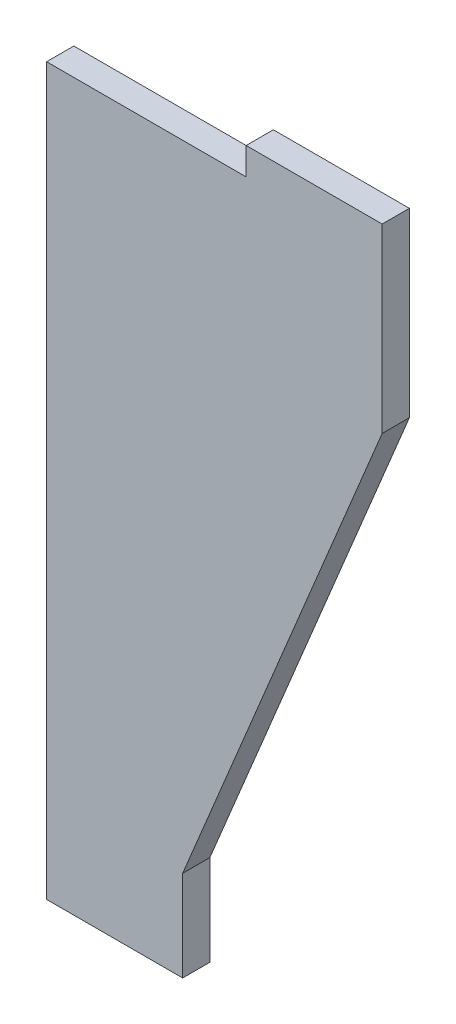
ISO-10303-21;
HEADER;
FILE_DESCRIPTION(('STEP AP214'),'2;1');
FILE_NAME('part.step','',(''),(''),'','','');
FILE_SCHEMA(('AUTOMOTIVE_DESIGN { 1 0 10303 214 1 1 1 1 }'));
ENDSEC;
DATA;
#1=APPLICATION_CONTEXT('core data for automotive mechanical design processes');
#2=APPLICATION_PROTOCOL_DEFINITION('international standard','automotive_design',2000,#1);
#3=PRODUCT_CONTEXT('',#1,'mechanical');
#4=PRODUCT('Part','Part','',(#3));
#5=PRODUCT_RELATED_PRODUCT_CATEGORY('part','',(#4));
#6=PRODUCT_DEFINITION_FORMATION('','',#4);
#7=PRODUCT_DEFINITION_CONTEXT('part definition',#1,'design');
#8=PRODUCT_DEFINITION('design','',#6,#7);
#9=PRODUCT_DEFINITION_SHAPE('','',#8);
#10=(LENGTH_UNIT() NAMED_UNIT(*) SI_UNIT(.MILLI.,.METRE.));
#11=(NAMED_UNIT(*) PLANE_ANGLE_UNIT() SI_UNIT($,.RADIAN.));
#12=(NAMED_UNIT(*) SI_UNIT($,.STERADIAN.) SOLID_ANGLE_UNIT());
#13=UNCERTAINTY_MEASURE_WITH_UNIT(LENGTH_MEASURE(1.E-05),#10,'distance_accuracy_value','');
#14=(GEOMETRIC_REPRESENTATION_CONTEXT(3) GLOBAL_UNCERTAINTY_ASSIGNED_CONTEXT((#13)) GLOBAL_UNIT_ASSIGNED_CONTEXT((#10,
#11,#12)) REPRESENTATION_CONTEXT('',''));
#15=CARTESIAN_POINT('',(0.,0.,0.));
#16=DIRECTION('',(0.,0.,1.));
#17=DIRECTION('',(1.,0.,0.));
#18=AXIS2_PLACEMENT_3D('',#15,#16,#17);
#19=CARTESIAN_POINT('',(0.,0.,-3.));
#20=DIRECTION('',(-1.,0.,0.));
#21=DIRECTION('',(0.,0.,1.));
#22=AXIS2_PLACEMENT_3D('',#19,#20,#21);
#23=PLANE('',#22);
#24=DIRECTION('',(0.,-1.,0.));
#25=VECTOR('',#24,1.);
#26=CARTESIAN_POINT('',(0.,0.,0.));
#27=LINE('',#26,#25);
#28=CARTESIAN_POINT('',(0.,0.,0.));
#29=VERTEX_POINT('',#28);
#30=CARTESIAN_POINT('',(0.,-80.,0.));
#31=VERTEX_POINT('',#30);
#32=EDGE_CURVE('E132',#29,#31,#27,.T.);
#33=ORIENTED_EDGE('',*,*,#32,.F.);
#34=DIRECTION('',(0.,0.,1.));
#35=VECTOR('',#34,1.);
#36=CARTESIAN_POINT('',(0.,0.,-3.));
#37=LINE('',#36,#35);
#38=CARTESIAN_POINT('',(0.,0.,-3.));
#39=VERTEX_POINT('',#38);
#40=EDGE_CURVE('E11',#39,#29,#37,.T.);
#41=ORIENTED_EDGE('',*,*,#40,.F.);
#42=DIRECTION('',(0.,-1.,0.));
#43=VECTOR('',#42,1.);
#44=CARTESIAN_POINT('',(0.,0.,-3.));
#45=LINE('',#44,#43);
#46=CARTESIAN_POINT('',(0.,-80.,-3.));
#47=VERTEX_POINT('',#46);
#48=EDGE_CURVE('E152',#39,#47,#45,.T.);
#49=ORIENTED_EDGE('',*,*,#48,.T.);
#50=DIRECTION('',(0.,0.,1.));
#51=VECTOR('',#50,1.);
#52=CARTESIAN_POINT('',(0.,-80.,-3.));
#53=LINE('',#52,#51);
#54=EDGE_CURVE('E38',#47,#31,#53,.T.);
#55=ORIENTED_EDGE('',*,*,#54,.T.);
#56=EDGE_LOOP('',(#33,#41,#49,#55));
#57=FACE_BOUND('',#56,.T.);
#58=ADVANCED_FACE('F35',(#57),#23,.T.);
#59=CARTESIAN_POINT('',(22.,0.,-3.));
#60=DIRECTION('',(0.,1.,0.));
#61=DIRECTION('',(-1.,0.,0.));
#62=AXIS2_PLACEMENT_3D('',#59,#60,#61);
#63=PLANE('',#62);
#64=DIRECTION('',(-1.,0.,0.));
#65=VECTOR('',#64,1.);
#66=CARTESIAN_POINT('',(22.,0.,0.));
#67=LINE('',#66,#65);
#68=CARTESIAN_POINT('',(22.,0.,0.));
#69=VERTEX_POINT('',#68);
#70=EDGE_CURVE('E150',#69,#29,#67,.T.);
#71=ORIENTED_EDGE('',*,*,#70,.F.);
#72=DIRECTION('',(0.,0.,1.));
#73=VECTOR('',#72,1.);
#74=CARTESIAN_POINT('',(22.,0.,-3.));
#75=LINE('',#74,#73);
#76=CARTESIAN_POINT('',(22.,0.,-3.));
#77=VERTEX_POINT('',#76);
#78=EDGE_CURVE('E44',#77,#69,#75,.T.);
#79=ORIENTED_EDGE('',*,*,#78,.F.);
#80=DIRECTION('',(-1.,0.,0.));
#81=VECTOR('',#80,1.);
#82=CARTESIAN_POINT('',(22.,0.,-3.));
#83=LINE('',#82,#81);
#84=EDGE_CURVE('E122',#77,#39,#83,.T.);
#85=ORIENTED_EDGE('',*,*,#84,.T.);
#86=ORIENTED_EDGE('',*,*,#40,.T.);
#87=EDGE_LOOP('',(#71,#79,#85,#86));
#88=FACE_BOUND('',#87,.T.);
#89=ADVANCED_FACE('F164',(#88),#63,.T.);
#90=CARTESIAN_POINT('',(22.,3.,-3.));
#91=DIRECTION('',(-1.,0.,0.));
#92=DIRECTION('',(0.,0.,1.));
#93=AXIS2_PLACEMENT_3D('',#90,#91,#92);
#94=PLANE('',#93);
#95=DIRECTION('',(0.,-1.,0.));
#96=VECTOR('',#95,1.);
#97=CARTESIAN_POINT('',(22.,3.,0.));
#98=LINE('',#97,#96);
#99=CARTESIAN_POINT('',(22.,3.,0.));
#100=VERTEX_POINT('',#99);
#101=EDGE_CURVE('E109',#100,#69,#98,.T.);
#102=ORIENTED_EDGE('',*,*,#101,.F.);
#103=DIRECTION('',(0.,0.,1.));
#104=VECTOR('',#103,1.);
#105=CARTESIAN_POINT('',(22.,3.,-3.));
#106=LINE('',#105,#104);
#107=CARTESIAN_POINT('',(22.,3.,-3.));
#108=VERTEX_POINT('',#107);
#109=EDGE_CURVE('E104',#108,#100,#106,.T.);
#110=ORIENTED_EDGE('',*,*,#109,.F.);
#111=DIRECTION('',(0.,-1.,0.));
#112=VECTOR('',#111,1.);
#113=CARTESIAN_POINT('',(22.,3.,-3.));
#114=LINE('',#113,#112);
#115=EDGE_CURVE('E107',#108,#77,#114,.T.);
#116=ORIENTED_EDGE('',*,*,#115,.T.);
#117=ORIENTED_EDGE('',*,*,#78,.T.);
#118=EDGE_LOOP('',(#102,#110,#116,#117));
#119=FACE_BOUND('',#118,.T.);
#120=ADVANCED_FACE('F106',(#119),#94,.T.);
#121=CARTESIAN_POINT('',(37.,3.00000000000001,-3.));
#122=DIRECTION('',(0.,1.,0.));
#123=DIRECTION('',(-1.,0.,0.));
#124=AXIS2_PLACEMENT_3D('',#121,#122,#123);
#125=PLANE('',#124);
#126=DIRECTION('',(-1.,0.,0.));
#127=VECTOR('',#126,1.);
#128=CARTESIAN_POINT('',(37.,3.00000000000001,0.));
#129=LINE('',#128,#127);
#130=CARTESIAN_POINT('',(37.,3.00000000000001,0.));
#131=VERTEX_POINT('',#130);
#132=EDGE_CURVE('E147',#131,#100,#129,.T.);
#133=ORIENTED_EDGE('',*,*,#132,.F.);
#134=DIRECTION('',(0.,0.,1.));
#135=VECTOR('',#134,1.);
#136=CARTESIAN_POINT('',(37.,3.00000000000001,-3.));
#137=LINE('',#136,#135);
#138=CARTESIAN_POINT('',(37.,3.00000000000001,-3.));
#139=VERTEX_POINT('',#138);
#140=EDGE_CURVE('E114',#139,#131,#137,.T.);
#141=ORIENTED_EDGE('',*,*,#140,.F.);
#142=DIRECTION('',(-1.,0.,0.));
#143=VECTOR('',#142,1.);
#144=CARTESIAN_POINT('',(37.,3.00000000000001,-3.));
#145=LINE('',#144,#143);
#146=EDGE_CURVE('E120',#139,#108,#145,.T.);
#147=ORIENTED_EDGE('',*,*,#146,.T.);
#148=ORIENTED_EDGE('',*,*,#109,.T.);
#149=EDGE_LOOP('',(#133,#141,#147,#148));
#150=FACE_BOUND('',#149,.T.);
#151=ADVANCED_FACE('F124',(#150),#125,.T.);
#152=CARTESIAN_POINT('',(37.,-17.,-3.));
#153=DIRECTION('',(1.,0.,0.));
#154=DIRECTION('',(0.,0.,-1.));
#155=AXIS2_PLACEMENT_3D('',#152,#153,#154);
#156=PLANE('',#155);
#157=DIRECTION('',(0.,1.,0.));
#158=VECTOR('',#157,1.);
#159=CARTESIAN_POINT('',(37.,-17.,0.));
#160=LINE('',#159,#158);
#161=CARTESIAN_POINT('',(37.,-17.,0.));
#162=VERTEX_POINT('',#161);
#163=EDGE_CURVE('E144',#162,#131,#160,.T.);
#164=ORIENTED_EDGE('',*,*,#163,.F.);
#165=DIRECTION('',(0.,0.,1.));
#166=VECTOR('',#165,1.);
#167=CARTESIAN_POINT('',(37.,-17.,-3.));
#168=LINE('',#167,#166);
#169=CARTESIAN_POINT('',(37.,-17.,-3.));
#170=VERTEX_POINT('',#169);
#171=EDGE_CURVE('E156',#170,#162,#168,.T.);
#172=ORIENTED_EDGE('',*,*,#171,.F.);
#173=DIRECTION('',(0.,1.,0.));
#174=VECTOR('',#173,1.);
#175=CARTESIAN_POINT('',(37.,-17.,-3.));
#176=LINE('',#175,#174);
#177=EDGE_CURVE('E125',#170,#139,#176,.T.);
#178=ORIENTED_EDGE('',*,*,#177,.T.);
#179=ORIENTED_EDGE('',*,*,#140,.T.);
#180=EDGE_LOOP('',(#164,#172,#178,#179));
#181=FACE_BOUND('',#180,.T.);
#182=ADVANCED_FACE('F177',(#181),#156,.T.);
#183=CARTESIAN_POINT('',(15.,-70.,-3.));
#184=DIRECTION('',(0.923591663500017,-0.383377671641517,0.));
#185=DIRECTION('',(0.383377671641517,0.923591663500017,0.));
#186=AXIS2_PLACEMENT_3D('',#183,#184,#185);
#187=PLANE('',#186);
#188=DIRECTION('',(0.383377671641517,0.923591663500017,0.));
#189=VECTOR('',#188,1.);
#190=CARTESIAN_POINT('',(15.,-70.,0.));
#191=LINE('',#190,#189);
#192=CARTESIAN_POINT('',(15.,-70.,0.));
#193=VERTEX_POINT('',#192);
#194=EDGE_CURVE('E141',#193,#162,#191,.T.);
#195=ORIENTED_EDGE('',*,*,#194,.F.);
#196=DIRECTION('',(0.,0.,1.));
#197=VECTOR('',#196,1.);
#198=CARTESIAN_POINT('',(15.,-70.,-3.));
#199=LINE('',#198,#197);
#200=CARTESIAN_POINT('',(15.,-70.,-3.));
#201=VERTEX_POINT('',#200);
#202=EDGE_CURVE('E158',#201,#193,#199,.T.);
#203=ORIENTED_EDGE('',*,*,#202,.F.);
#204=DIRECTION('',(0.383377671641517,0.923591663500017,0.));
#205=VECTOR('',#204,1.);
#206=CARTESIAN_POINT('',(15.,-70.,-3.));
#207=LINE('',#206,#205);
#208=EDGE_CURVE('E127',#201,#170,#207,.T.);
#209=ORIENTED_EDGE('',*,*,#208,.T.);
#210=ORIENTED_EDGE('',*,*,#171,.T.);
#211=EDGE_LOOP('',(#195,#203,#209,#210));
#212=FACE_BOUND('',#211,.T.);
#213=ADVANCED_FACE('F180',(#212),#187,.T.);
#214=CARTESIAN_POINT('',(15.,-80.,-3.));
#215=DIRECTION('',(1.,0.,0.));
#216=DIRECTION('',(0.,0.,-1.));
#217=AXIS2_PLACEMENT_3D('',#214,#215,#216);
#218=PLANE('',#217);
#219=DIRECTION('',(0.,1.,0.));
#220=VECTOR('',#219,1.);
#221=CARTESIAN_POINT('',(15.,-80.,0.));
#222=LINE('',#221,#220);
#223=CARTESIAN_POINT('',(15.,-80.,0.));
#224=VERTEX_POINT('',#223);
#225=EDGE_CURVE('E138',#224,#193,#222,.T.);
#226=ORIENTED_EDGE('',*,*,#225,.F.);
#227=DIRECTION('',(0.,0.,1.));
#228=VECTOR('',#227,1.);
#229=CARTESIAN_POINT('',(15.,-80.,-3.));
#230=LINE('',#229,#228);
#231=CARTESIAN_POINT('',(15.,-80.,-3.));
#232=VERTEX_POINT('',#231);
#233=EDGE_CURVE('E159',#232,#224,#230,.T.);
#234=ORIENTED_EDGE('',*,*,#233,.F.);
#235=DIRECTION('',(0.,1.,0.));
#236=VECTOR('',#235,1.);
#237=CARTESIAN_POINT('',(15.,-80.,-3.));
#238=LINE('',#237,#236);
#239=EDGE_CURVE('E255',#232,#201,#238,.T.);
#240=ORIENTED_EDGE('',*,*,#239,.T.);
#241=ORIENTED_EDGE('',*,*,#202,.T.);
#242=EDGE_LOOP('',(#226,#234,#240,#241));
#243=FACE_BOUND('',#242,.T.);
#244=ADVANCED_FACE('F184',(#243),#218,.T.);
#245=CARTESIAN_POINT('',(0.,-80.,-3.));
#246=DIRECTION('',(0.,-1.,0.));
#247=DIRECTION('',(1.,0.,0.));
#248=AXIS2_PLACEMENT_3D('',#245,#246,#247);
#249=PLANE('',#248);
#250=DIRECTION('',(1.,0.,0.));
#251=VECTOR('',#250,1.);
#252=CARTESIAN_POINT('',(0.,-80.,0.));
#253=LINE('',#252,#251);
#254=EDGE_CURVE('E135',#31,#224,#253,.T.);
#255=ORIENTED_EDGE('',*,*,#254,.F.);
#256=ORIENTED_EDGE('',*,*,#54,.F.);
#257=DIRECTION('',(1.,0.,0.));
#258=VECTOR('',#257,1.);
#259=CARTESIAN_POINT('',(0.,-80.,-3.));
#260=LINE('',#259,#258);
#261=EDGE_CURVE('E256',#47,#232,#260,.T.);
#262=ORIENTED_EDGE('',*,*,#261,.T.);
#263=ORIENTED_EDGE('',*,*,#233,.T.);
#264=EDGE_LOOP('',(#255,#256,#262,#263));
#265=FACE_BOUND('',#264,.T.);
#266=ADVANCED_FACE('F161',(#265),#249,.T.);
#267=CARTESIAN_POINT('',(0.,0.,-3.));
#268=DIRECTION('',(0.,0.,1.));
#269=DIRECTION('',(1.,0.,0.));
#270=AXIS2_PLACEMENT_3D('',#267,#268,#269);
#271=PLANE('',#270);
#272=ORIENTED_EDGE('',*,*,#48,.F.);
#273=ORIENTED_EDGE('',*,*,#84,.F.);
#274=ORIENTED_EDGE('',*,*,#115,.F.);
#275=ORIENTED_EDGE('',*,*,#146,.F.);
#276=ORIENTED_EDGE('',*,*,#177,.F.);
#277=ORIENTED_EDGE('',*,*,#208,.F.);
#278=ORIENTED_EDGE('',*,*,#239,.F.);
#279=ORIENTED_EDGE('',*,*,#261,.F.);
#280=EDGE_LOOP('',(#272,#273,#274,#275,#276,#277,#278,#279));
#281=FACE_BOUND('',#280,.T.);
#282=ADVANCED_FACE('F118',(#281),#271,.F.);
#283=CARTESIAN_POINT('',(0.,0.,0.));
#284=DIRECTION('',(0.,0.,1.));
#285=DIRECTION('',(1.,0.,0.));
#286=AXIS2_PLACEMENT_3D('',#283,#284,#285);
#287=PLANE('',#286);
#288=ORIENTED_EDGE('',*,*,#32,.T.);
#289=ORIENTED_EDGE('',*,*,#254,.T.);
#290=ORIENTED_EDGE('',*,*,#225,.T.);
#291=ORIENTED_EDGE('',*,*,#194,.T.);
#292=ORIENTED_EDGE('',*,*,#163,.T.);
#293=ORIENTED_EDGE('',*,*,#132,.T.);
#294=ORIENTED_EDGE('',*,*,#101,.T.);
#295=ORIENTED_EDGE('',*,*,#70,.T.);
#296=EDGE_LOOP('',(#288,#289,#290,#291,#292,#293,#294,#295));
#297=FACE_BOUND('',#296,.T.);
#298=ADVANCED_FACE('F163',(#297),#287,.T.);
#299=CLOSED_SHELL('',(#58,#89,#120,#151,#182,#213,#244,#266,#282,#298));
#300=MANIFOLD_SOLID_BREP('B2',#299);
#301=ADVANCED_BREP_SHAPE_REPRESENTATION('',(#18,#300),#14);
#302=SHAPE_DEFINITION_REPRESENTATION(#9,#301);
ENDSEC;
END-ISO-10303-21;
